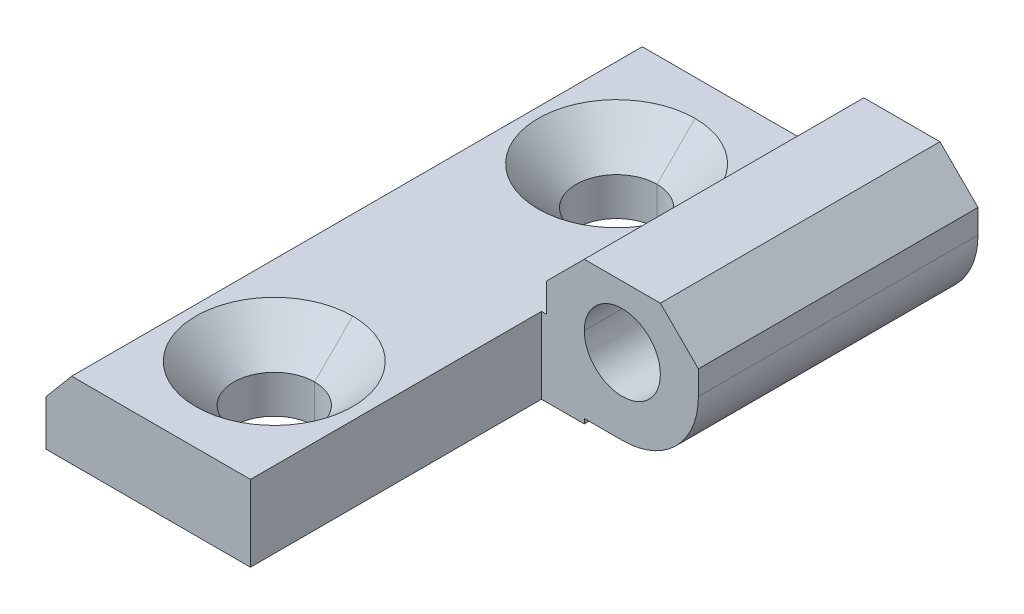
ISO-10303-21;
HEADER;
FILE_DESCRIPTION(('STEP AP214'),'2;1');
FILE_NAME('part.step','',(''),(''),'','','');
FILE_SCHEMA(('AUTOMOTIVE_DESIGN { 1 0 10303 214 1 1 1 1 }'));
ENDSEC;
DATA;
#1=APPLICATION_CONTEXT('core data for automotive mechanical design processes');
#2=APPLICATION_PROTOCOL_DEFINITION('international standard','automotive_design',2000,#1);
#3=PRODUCT_CONTEXT('',#1,'mechanical');
#4=PRODUCT('Part','Part','',(#3));
#5=PRODUCT_RELATED_PRODUCT_CATEGORY('part','',(#4));
#6=PRODUCT_DEFINITION_FORMATION('','',#4);
#7=PRODUCT_DEFINITION_CONTEXT('part definition',#1,'design');
#8=PRODUCT_DEFINITION('design','',#6,#7);
#9=PRODUCT_DEFINITION_SHAPE('','',#8);
#10=(LENGTH_UNIT() NAMED_UNIT(*) SI_UNIT(.MILLI.,.METRE.));
#11=(NAMED_UNIT(*) PLANE_ANGLE_UNIT() SI_UNIT($,.RADIAN.));
#12=(NAMED_UNIT(*) SI_UNIT($,.STERADIAN.) SOLID_ANGLE_UNIT());
#13=UNCERTAINTY_MEASURE_WITH_UNIT(LENGTH_MEASURE(1.E-05),#10,'distance_accuracy_value','');
#14=(GEOMETRIC_REPRESENTATION_CONTEXT(3) GLOBAL_UNCERTAINTY_ASSIGNED_CONTEXT((#13)) GLOBAL_UNIT_ASSIGNED_CONTEXT((#10,
#11,#12)) REPRESENTATION_CONTEXT('',''));
#15=CARTESIAN_POINT('',(0.,0.,0.));
#16=DIRECTION('',(0.,0.,1.));
#17=DIRECTION('',(1.,0.,0.));
#18=AXIS2_PLACEMENT_3D('',#15,#16,#17);
#19=CARTESIAN_POINT('',(0.,0.,60.));
#20=DIRECTION('',(0.,1.,0.));
#21=DIRECTION('',(0.,0.,1.));
#22=AXIS2_PLACEMENT_3D('',#19,#20,#21);
#23=PLANE('',#22);
#24=CARTESIAN_POINT('',(12.,0.,12.));
#25=DIRECTION('',(0.,-1.,0.));
#26=DIRECTION('',(0.,0.,-1.));
#27=AXIS2_PLACEMENT_3D('',#24,#25,#26);
#28=CIRCLE('',#27,4.25);
#29=CARTESIAN_POINT('',(12.,0.,16.25));
#30=VERTEX_POINT('',#29);
#31=CARTESIAN_POINT('',(12.,0.,7.75));
#32=VERTEX_POINT('',#31);
#33=EDGE_CURVE('E11',#30,#32,#28,.T.);
#34=ORIENTED_EDGE('',*,*,#33,.F.);
#35=CARTESIAN_POINT('',(12.,0.,12.));
#36=DIRECTION('',(0.,-1.,0.));
#37=DIRECTION('',(0.,0.,-1.));
#38=AXIS2_PLACEMENT_3D('',#35,#36,#37);
#39=CIRCLE('',#38,4.25);
#40=EDGE_CURVE('E26',#32,#30,#39,.T.);
#41=ORIENTED_EDGE('',*,*,#40,.F.);
#42=EDGE_LOOP('',(#34,#41));
#43=FACE_BOUND('',#42,.T.);
#44=CARTESIAN_POINT('',(12.,0.,48.));
#45=DIRECTION('',(0.,-1.,0.));
#46=DIRECTION('',(0.,0.,-1.));
#47=AXIS2_PLACEMENT_3D('',#44,#45,#46);
#48=CIRCLE('',#47,4.25);
#49=CARTESIAN_POINT('',(12.,0.,52.25));
#50=VERTEX_POINT('',#49);
#51=CARTESIAN_POINT('',(12.,0.,43.75));
#52=VERTEX_POINT('',#51);
#53=EDGE_CURVE('E578',#50,#52,#48,.T.);
#54=ORIENTED_EDGE('',*,*,#53,.F.);
#55=CARTESIAN_POINT('',(12.,0.,48.));
#56=DIRECTION('',(0.,-1.,0.));
#57=DIRECTION('',(0.,0.,-1.));
#58=AXIS2_PLACEMENT_3D('',#55,#56,#57);
#59=CIRCLE('',#58,4.25);
#60=EDGE_CURVE('E572',#52,#50,#59,.T.);
#61=ORIENTED_EDGE('',*,*,#60,.F.);
#62=EDGE_LOOP('',(#54,#61));
#63=FACE_BOUND('',#62,.T.);
#64=DIRECTION('',(0.,0.,-1.));
#65=VECTOR('',#64,1.);
#66=CARTESIAN_POINT('',(21.5,0.,60.));
#67=LINE('',#66,#65);
#68=CARTESIAN_POINT('',(21.5,0.,60.));
#69=VERTEX_POINT('',#68);
#70=CARTESIAN_POINT('',(21.5,0.,29.4));
#71=VERTEX_POINT('',#70);
#72=EDGE_CURVE('E566',#69,#71,#67,.T.);
#73=ORIENTED_EDGE('',*,*,#72,.F.);
#74=DIRECTION('',(1.,0.,0.));
#75=VECTOR('',#74,1.);
#76=CARTESIAN_POINT('',(0.,0.,60.));
#77=LINE('',#76,#75);
#78=CARTESIAN_POINT('',(0.,0.,60.));
#79=VERTEX_POINT('',#78);
#80=EDGE_CURVE('E560',#79,#69,#77,.T.);
#81=ORIENTED_EDGE('',*,*,#80,.F.);
#82=DIRECTION('',(0.,0.,-1.));
#83=VECTOR('',#82,1.);
#84=CARTESIAN_POINT('',(0.,0.,60.));
#85=LINE('',#84,#83);
#86=CARTESIAN_POINT('',(0.,0.,0.));
#87=VERTEX_POINT('',#86);
#88=EDGE_CURVE('E555',#79,#87,#85,.T.);
#89=ORIENTED_EDGE('',*,*,#88,.T.);
#90=DIRECTION('',(1.,0.,0.));
#91=VECTOR('',#90,1.);
#92=CARTESIAN_POINT('',(0.,0.,0.));
#93=LINE('',#92,#91);
#94=CARTESIAN_POINT('',(26.,0.,0.));
#95=VERTEX_POINT('',#94);
#96=EDGE_CURVE('E550',#87,#95,#93,.T.);
#97=ORIENTED_EDGE('',*,*,#96,.T.);
#98=DIRECTION('',(0.,0.,-1.));
#99=VECTOR('',#98,1.);
#100=CARTESIAN_POINT('',(26.,0.,60.));
#101=LINE('',#100,#99);
#102=CARTESIAN_POINT('',(26.,0.,29.4));
#103=VERTEX_POINT('',#102);
#104=EDGE_CURVE('E544',#103,#95,#101,.T.);
#105=ORIENTED_EDGE('',*,*,#104,.F.);
#106=DIRECTION('',(1.,0.,0.));
#107=VECTOR('',#106,1.);
#108=CARTESIAN_POINT('',(21.5,0.,29.4));
#109=LINE('',#108,#107);
#110=EDGE_CURVE('E538',#71,#103,#109,.T.);
#111=ORIENTED_EDGE('',*,*,#110,.F.);
#112=EDGE_LOOP('',(#73,#81,#89,#97,#105,#111));
#113=FACE_BOUND('',#112,.T.);
#114=ADVANCED_FACE('F17',(#43,#63,#113),#23,.F.);
#115=CARTESIAN_POINT('',(0.,0.,29.4));
#116=DIRECTION('',(0.,0.,1.));
#117=DIRECTION('',(1.,0.,0.));
#118=AXIS2_PLACEMENT_3D('',#115,#116,#117);
#119=PLANE('',#118);
#120=CARTESIAN_POINT('',(30.,8.5,29.4));
#121=DIRECTION('',(0.,0.,1.));
#122=DIRECTION('',(1.,0.,0.));
#123=AXIS2_PLACEMENT_3D('',#120,#121,#122);
#124=CIRCLE('',#123,4.);
#125=CARTESIAN_POINT('',(26.,8.5,29.4));
#126=VERTEX_POINT('',#125);
#127=CARTESIAN_POINT('',(34.,8.5,29.4));
#128=VERTEX_POINT('',#127);
#129=EDGE_CURVE('E224',#126,#128,#124,.T.);
#130=ORIENTED_EDGE('',*,*,#129,.F.);
#131=CARTESIAN_POINT('',(30.,8.5,29.4));
#132=DIRECTION('',(0.,0.,1.));
#133=DIRECTION('',(1.,0.,0.));
#134=AXIS2_PLACEMENT_3D('',#131,#132,#133);
#135=CIRCLE('',#134,4.);
#136=EDGE_CURVE('E529',#128,#126,#135,.T.);
#137=ORIENTED_EDGE('',*,*,#136,.F.);
#138=EDGE_LOOP('',(#130,#137));
#139=FACE_BOUND('',#138,.T.);
#140=DIRECTION('',(0.,1.,0.));
#141=VECTOR('',#140,1.);
#142=CARTESIAN_POINT('',(26.,0.,29.4));
#143=LINE('',#142,#141);
#144=CARTESIAN_POINT('',(26.,0.5,29.4));
#145=VERTEX_POINT('',#144);
#146=EDGE_CURVE('E524',#103,#145,#143,.T.);
#147=ORIENTED_EDGE('',*,*,#146,.T.);
#148=DIRECTION('',(1.,0.,0.));
#149=VECTOR('',#148,1.);
#150=CARTESIAN_POINT('',(26.,0.5,29.4));
#151=LINE('',#150,#149);
#152=CARTESIAN_POINT('',(30.,0.5,29.4));
#153=VERTEX_POINT('',#152);
#154=EDGE_CURVE('E519',#145,#153,#151,.T.);
#155=ORIENTED_EDGE('',*,*,#154,.T.);
#156=CARTESIAN_POINT('',(29.9999999999994,8.50000000000062,29.4));
#157=DIRECTION('',(0.,0.,1.));
#158=DIRECTION('',(1.,0.,0.));
#159=AXIS2_PLACEMENT_3D('',#156,#157,#158);
#160=CIRCLE('',#159,8.00000000000062);
#161=CARTESIAN_POINT('',(38.,8.5,29.4));
#162=VERTEX_POINT('',#161);
#163=EDGE_CURVE('E514',#153,#162,#160,.T.);
#164=ORIENTED_EDGE('',*,*,#163,.T.);
#165=DIRECTION('',(0.,1.,0.));
#166=VECTOR('',#165,1.);
#167=CARTESIAN_POINT('',(38.,0.,29.4));
#168=LINE('',#167,#166);
#169=CARTESIAN_POINT('',(38.,11.015640288664,29.4));
#170=VERTEX_POINT('',#169);
#171=EDGE_CURVE('E509',#162,#170,#168,.T.);
#172=ORIENTED_EDGE('',*,*,#171,.T.);
#173=DIRECTION('',(-0.708490549139333,0.705720299963269,0.));
#174=VECTOR('',#173,1.);
#175=CARTESIAN_POINT('',(38.,11.015640288664,29.4));
#176=LINE('',#175,#174);
#177=CARTESIAN_POINT('',(34.,15.,29.4));
#178=VERTEX_POINT('',#177);
#179=EDGE_CURVE('E504',#170,#178,#176,.T.);
#180=ORIENTED_EDGE('',*,*,#179,.T.);
#181=DIRECTION('',(-1.,0.,0.));
#182=VECTOR('',#181,1.);
#183=CARTESIAN_POINT('',(38.,15.,29.4));
#184=LINE('',#183,#182);
#185=CARTESIAN_POINT('',(26.,15.,29.4));
#186=VERTEX_POINT('',#185);
#187=EDGE_CURVE('E499',#178,#186,#184,.T.);
#188=ORIENTED_EDGE('',*,*,#187,.T.);
#189=DIRECTION('',(-0.707106781186548,-0.707106781186547,0.));
#190=VECTOR('',#189,1.);
#191=CARTESIAN_POINT('',(26.,15.,29.4));
#192=LINE('',#191,#190);
#193=CARTESIAN_POINT('',(22.015640288664,11.015640288664,29.4));
#194=VERTEX_POINT('',#193);
#195=EDGE_CURVE('E494',#186,#194,#192,.T.);
#196=ORIENTED_EDGE('',*,*,#195,.T.);
#197=DIRECTION('',(0.,-1.,0.));
#198=VECTOR('',#197,1.);
#199=CARTESIAN_POINT('',(22.015640288664,11.015640288664,29.4));
#200=LINE('',#199,#198);
#201=CARTESIAN_POINT('',(22.015640288664,8.,29.4));
#202=VERTEX_POINT('',#201);
#203=EDGE_CURVE('E489',#194,#202,#200,.T.);
#204=ORIENTED_EDGE('',*,*,#203,.T.);
#205=DIRECTION('',(-1.,0.,0.));
#206=VECTOR('',#205,1.);
#207=CARTESIAN_POINT('',(22.015640288664,8.,29.4));
#208=LINE('',#207,#206);
#209=CARTESIAN_POINT('',(21.5,8.,29.4));
#210=VERTEX_POINT('',#209);
#211=EDGE_CURVE('E484',#202,#210,#208,.T.);
#212=ORIENTED_EDGE('',*,*,#211,.T.);
#213=DIRECTION('',(0.,-1.,0.));
#214=VECTOR('',#213,1.);
#215=CARTESIAN_POINT('',(21.5,15.,29.4));
#216=LINE('',#215,#214);
#217=EDGE_CURVE('E478',#210,#71,#216,.T.);
#218=ORIENTED_EDGE('',*,*,#217,.T.);
#219=ORIENTED_EDGE('',*,*,#110,.T.);
#220=EDGE_LOOP('',(#147,#155,#164,#172,#180,#188,#196,#204,#212,#218,#219));
#221=FACE_BOUND('',#220,.T.);
#222=ADVANCED_FACE('F623',(#139,#221),#119,.T.);
#223=CARTESIAN_POINT('',(21.5,15.,60.));
#224=DIRECTION('',(1.,0.,0.));
#225=DIRECTION('',(0.,0.,-1.));
#226=AXIS2_PLACEMENT_3D('',#223,#224,#225);
#227=PLANE('',#226);
#228=DIRECTION('',(0.,0.,1.));
#229=VECTOR('',#228,1.);
#230=CARTESIAN_POINT('',(21.5,8.,60.));
#231=LINE('',#230,#229);
#232=CARTESIAN_POINT('',(21.5,8.,60.));
#233=VERTEX_POINT('',#232);
#234=EDGE_CURVE('E473',#210,#233,#231,.T.);
#235=ORIENTED_EDGE('',*,*,#234,.T.);
#236=DIRECTION('',(0.,1.,0.));
#237=VECTOR('',#236,1.);
#238=CARTESIAN_POINT('',(21.5,8.50000000000062,60.));
#239=LINE('',#238,#237);
#240=EDGE_CURVE('E467',#69,#233,#239,.T.);
#241=ORIENTED_EDGE('',*,*,#240,.F.);
#242=ORIENTED_EDGE('',*,*,#72,.T.);
#243=ORIENTED_EDGE('',*,*,#217,.F.);
#244=EDGE_LOOP('',(#235,#241,#242,#243));
#245=FACE_BOUND('',#244,.T.);
#246=ADVANCED_FACE('F621',(#245),#227,.T.);
#247=CARTESIAN_POINT('',(29.9999999999994,8.50000000000062,60.));
#248=DIRECTION('',(0.,0.,1.));
#249=DIRECTION('',(1.,0.,0.));
#250=AXIS2_PLACEMENT_3D('',#247,#248,#249);
#251=PLANE('',#250);
#252=ORIENTED_EDGE('',*,*,#80,.T.);
#253=ORIENTED_EDGE('',*,*,#240,.T.);
#254=DIRECTION('',(-1.,0.,0.));
#255=VECTOR('',#254,1.);
#256=CARTESIAN_POINT('',(22.015640288664,8.,60.));
#257=LINE('',#256,#255);
#258=CARTESIAN_POINT('',(2.6997079606835,8.,60.));
#259=VERTEX_POINT('',#258);
#260=EDGE_CURVE('E462',#233,#259,#257,.T.);
#261=ORIENTED_EDGE('',*,*,#260,.T.);
#262=DIRECTION('',(-0.642787609686545,-0.766044443118973,0.));
#263=VECTOR('',#262,1.);
#264=CARTESIAN_POINT('',(2.6997079606835,8.,60.));
#265=LINE('',#264,#263);
#266=CARTESIAN_POINT('',(0.,4.7826133389003,60.));
#267=VERTEX_POINT('',#266);
#268=EDGE_CURVE('E457',#259,#267,#265,.T.);
#269=ORIENTED_EDGE('',*,*,#268,.T.);
#270=DIRECTION('',(0.,-1.,0.));
#271=VECTOR('',#270,1.);
#272=CARTESIAN_POINT('',(0.,4.7826133389003,60.));
#273=LINE('',#272,#271);
#274=EDGE_CURVE('E451',#267,#79,#273,.T.);
#275=ORIENTED_EDGE('',*,*,#274,.T.);
#276=EDGE_LOOP('',(#252,#253,#261,#269,#275));
#277=FACE_BOUND('',#276,.T.);
#278=ADVANCED_FACE('F639',(#277),#251,.T.);
#279=CARTESIAN_POINT('',(0.,4.7826133389003,60.));
#280=DIRECTION('',(1.,0.,0.));
#281=DIRECTION('',(0.,0.,-1.));
#282=AXIS2_PLACEMENT_3D('',#279,#280,#281);
#283=PLANE('',#282);
#284=DIRECTION('',(0.,-1.,0.));
#285=VECTOR('',#284,1.);
#286=CARTESIAN_POINT('',(0.,4.7826133389003,0.));
#287=LINE('',#286,#285);
#288=CARTESIAN_POINT('',(0.,4.7826133389003,0.));
#289=VERTEX_POINT('',#288);
#290=EDGE_CURVE('E445',#289,#87,#287,.T.);
#291=ORIENTED_EDGE('',*,*,#290,.T.);
#292=ORIENTED_EDGE('',*,*,#88,.F.);
#293=ORIENTED_EDGE('',*,*,#274,.F.);
#294=DIRECTION('',(0.,0.,-1.));
#295=VECTOR('',#294,1.);
#296=CARTESIAN_POINT('',(0.,4.7826133389003,60.));
#297=LINE('',#296,#295);
#298=EDGE_CURVE('E440',#267,#289,#297,.T.);
#299=ORIENTED_EDGE('',*,*,#298,.T.);
#300=EDGE_LOOP('',(#291,#292,#293,#299));
#301=FACE_BOUND('',#300,.T.);
#302=ADVANCED_FACE('F848',(#301),#283,.F.);
#303=CARTESIAN_POINT('',(2.6997079606835,8.,60.));
#304=DIRECTION('',(0.766044443118973,-0.642787609686545,0.));
#305=DIRECTION('',(0.642787609686545,0.766044443118973,0.));
#306=AXIS2_PLACEMENT_3D('',#303,#304,#305);
#307=PLANE('',#306);
#308=DIRECTION('',(-0.642787609686545,-0.766044443118973,0.));
#309=VECTOR('',#308,1.);
#310=CARTESIAN_POINT('',(2.6997079606835,8.,0.));
#311=LINE('',#310,#309);
#312=CARTESIAN_POINT('',(2.6997079606835,8.,0.));
#313=VERTEX_POINT('',#312);
#314=EDGE_CURVE('E434',#313,#289,#311,.T.);
#315=ORIENTED_EDGE('',*,*,#314,.T.);
#316=ORIENTED_EDGE('',*,*,#298,.F.);
#317=ORIENTED_EDGE('',*,*,#268,.F.);
#318=DIRECTION('',(0.,0.,-1.));
#319=VECTOR('',#318,1.);
#320=CARTESIAN_POINT('',(2.6997079606835,8.,60.));
#321=LINE('',#320,#319);
#322=EDGE_CURVE('E429',#259,#313,#321,.T.);
#323=ORIENTED_EDGE('',*,*,#322,.T.);
#324=EDGE_LOOP('',(#315,#316,#317,#323));
#325=FACE_BOUND('',#324,.T.);
#326=ADVANCED_FACE('F609',(#325),#307,.F.);
#327=CARTESIAN_POINT('',(22.015640288664,8.,60.));
#328=DIRECTION('',(0.,-1.,0.));
#329=DIRECTION('',(0.,0.,-1.));
#330=AXIS2_PLACEMENT_3D('',#327,#328,#329);
#331=PLANE('',#330);
#332=CARTESIAN_POINT('',(12.,8.,12.));
#333=DIRECTION('',(0.,-1.,0.));
#334=DIRECTION('',(0.,0.,-1.));
#335=AXIS2_PLACEMENT_3D('',#332,#333,#334);
#336=CIRCLE('',#335,8.25);
#337=CARTESIAN_POINT('',(12.,8.,3.75));
#338=VERTEX_POINT('',#337);
#339=CARTESIAN_POINT('',(12.,8.,20.25));
#340=VERTEX_POINT('',#339);
#341=EDGE_CURVE('E424',#338,#340,#336,.T.);
#342=ORIENTED_EDGE('',*,*,#341,.T.);
#343=CARTESIAN_POINT('',(12.,8.,12.));
#344=DIRECTION('',(0.,-1.,0.));
#345=DIRECTION('',(0.,0.,-1.));
#346=AXIS2_PLACEMENT_3D('',#343,#344,#345);
#347=CIRCLE('',#346,8.25);
#348=EDGE_CURVE('E420',#340,#338,#347,.T.);
#349=ORIENTED_EDGE('',*,*,#348,.T.);
#350=EDGE_LOOP('',(#342,#349));
#351=FACE_BOUND('',#350,.T.);
#352=CARTESIAN_POINT('',(12.,8.,48.));
#353=DIRECTION('',(0.,-1.,0.));
#354=DIRECTION('',(0.,0.,-1.));
#355=AXIS2_PLACEMENT_3D('',#352,#353,#354);
#356=CIRCLE('',#355,8.25);
#357=CARTESIAN_POINT('',(12.,8.,39.75));
#358=VERTEX_POINT('',#357);
#359=CARTESIAN_POINT('',(12.,8.,56.25));
#360=VERTEX_POINT('',#359);
#361=EDGE_CURVE('E415',#358,#360,#356,.T.);
#362=ORIENTED_EDGE('',*,*,#361,.T.);
#363=CARTESIAN_POINT('',(12.,8.,48.));
#364=DIRECTION('',(0.,-1.,0.));
#365=DIRECTION('',(0.,0.,-1.));
#366=AXIS2_PLACEMENT_3D('',#363,#364,#365);
#367=CIRCLE('',#366,8.25);
#368=EDGE_CURVE('E410',#360,#358,#367,.T.);
#369=ORIENTED_EDGE('',*,*,#368,.T.);
#370=EDGE_LOOP('',(#362,#369));
#371=FACE_BOUND('',#370,.T.);
#372=ORIENTED_EDGE('',*,*,#234,.F.);
#373=ORIENTED_EDGE('',*,*,#211,.F.);
#374=DIRECTION('',(0.,0.,-1.));
#375=VECTOR('',#374,1.);
#376=CARTESIAN_POINT('',(22.015640288664,8.,60.));
#377=LINE('',#376,#375);
#378=CARTESIAN_POINT('',(22.015640288664,8.,0.));
#379=VERTEX_POINT('',#378);
#380=EDGE_CURVE('E405',#202,#379,#377,.T.);
#381=ORIENTED_EDGE('',*,*,#380,.T.);
#382=DIRECTION('',(-1.,0.,0.));
#383=VECTOR('',#382,1.);
#384=CARTESIAN_POINT('',(22.015640288664,8.,0.));
#385=LINE('',#384,#383);
#386=EDGE_CURVE('E399',#379,#313,#385,.T.);
#387=ORIENTED_EDGE('',*,*,#386,.T.);
#388=ORIENTED_EDGE('',*,*,#322,.F.);
#389=ORIENTED_EDGE('',*,*,#260,.F.);
#390=EDGE_LOOP('',(#372,#373,#381,#387,#388,#389));
#391=FACE_BOUND('',#390,.T.);
#392=ADVANCED_FACE('F605',(#351,#371,#391),#331,.F.);
#393=CARTESIAN_POINT('',(29.9999999999994,8.50000000000062,0.));
#394=DIRECTION('',(0.,0.,1.));
#395=DIRECTION('',(1.,0.,0.));
#396=AXIS2_PLACEMENT_3D('',#393,#394,#395);
#397=PLANE('',#396);
#398=ORIENTED_EDGE('',*,*,#314,.F.);
#399=ORIENTED_EDGE('',*,*,#386,.F.);
#400=DIRECTION('',(0.,-1.,0.));
#401=VECTOR('',#400,1.);
#402=CARTESIAN_POINT('',(22.015640288664,11.015640288664,0.));
#403=LINE('',#402,#401);
#404=CARTESIAN_POINT('',(22.015640288664,11.015640288664,0.));
#405=VERTEX_POINT('',#404);
#406=EDGE_CURVE('E393',#405,#379,#403,.T.);
#407=ORIENTED_EDGE('',*,*,#406,.F.);
#408=DIRECTION('',(-0.707106781186548,-0.707106781186547,0.));
#409=VECTOR('',#408,1.);
#410=CARTESIAN_POINT('',(26.,15.,0.));
#411=LINE('',#410,#409);
#412=CARTESIAN_POINT('',(26.,15.,0.));
#413=VERTEX_POINT('',#412);
#414=EDGE_CURVE('E387',#413,#405,#411,.T.);
#415=ORIENTED_EDGE('',*,*,#414,.F.);
#416=DIRECTION('',(-1.,0.,0.));
#417=VECTOR('',#416,1.);
#418=CARTESIAN_POINT('',(34.,15.,0.));
#419=LINE('',#418,#417);
#420=CARTESIAN_POINT('',(34.,15.,0.));
#421=VERTEX_POINT('',#420);
#422=EDGE_CURVE('E381',#421,#413,#419,.T.);
#423=ORIENTED_EDGE('',*,*,#422,.F.);
#424=DIRECTION('',(-0.708490549139333,0.705720299963269,0.));
#425=VECTOR('',#424,1.);
#426=CARTESIAN_POINT('',(38.,11.015640288664,0.));
#427=LINE('',#426,#425);
#428=CARTESIAN_POINT('',(38.,11.015640288664,0.));
#429=VERTEX_POINT('',#428);
#430=EDGE_CURVE('E375',#429,#421,#427,.T.);
#431=ORIENTED_EDGE('',*,*,#430,.F.);
#432=DIRECTION('',(0.,1.,0.));
#433=VECTOR('',#432,1.);
#434=CARTESIAN_POINT('',(38.,8.5,0.));
#435=LINE('',#434,#433);
#436=CARTESIAN_POINT('',(38.,8.5,0.));
#437=VERTEX_POINT('',#436);
#438=EDGE_CURVE('E369',#437,#429,#435,.T.);
#439=ORIENTED_EDGE('',*,*,#438,.F.);
#440=CARTESIAN_POINT('',(29.9999999999994,8.50000000000062,0.));
#441=DIRECTION('',(0.,0.,1.));
#442=DIRECTION('',(1.,0.,0.));
#443=AXIS2_PLACEMENT_3D('',#440,#441,#442);
#444=CIRCLE('',#443,8.00000000000062);
#445=CARTESIAN_POINT('',(30.,0.5,0.));
#446=VERTEX_POINT('',#445);
#447=EDGE_CURVE('E363',#446,#437,#444,.T.);
#448=ORIENTED_EDGE('',*,*,#447,.F.);
#449=DIRECTION('',(1.,0.,0.));
#450=VECTOR('',#449,1.);
#451=CARTESIAN_POINT('',(26.,0.5,0.));
#452=LINE('',#451,#450);
#453=CARTESIAN_POINT('',(26.,0.5,0.));
#454=VERTEX_POINT('',#453);
#455=EDGE_CURVE('E357',#454,#446,#452,.T.);
#456=ORIENTED_EDGE('',*,*,#455,.F.);
#457=DIRECTION('',(0.,1.,0.));
#458=VECTOR('',#457,1.);
#459=CARTESIAN_POINT('',(26.,0.,0.));
#460=LINE('',#459,#458);
#461=EDGE_CURVE('E351',#95,#454,#460,.T.);
#462=ORIENTED_EDGE('',*,*,#461,.F.);
#463=ORIENTED_EDGE('',*,*,#96,.F.);
#464=ORIENTED_EDGE('',*,*,#290,.F.);
#465=EDGE_LOOP('',(#398,#399,#407,#415,#423,#431,#439,#448,#456,#462,#463,#464));
#466=FACE_BOUND('',#465,.T.);
#467=ADVANCED_FACE('F608',(#466),#397,.F.);
#468=CARTESIAN_POINT('',(26.,0.,60.));
#469=DIRECTION('',(-1.,0.,0.));
#470=DIRECTION('',(0.,0.,1.));
#471=AXIS2_PLACEMENT_3D('',#468,#469,#470);
#472=PLANE('',#471);
#473=ORIENTED_EDGE('',*,*,#146,.F.);
#474=ORIENTED_EDGE('',*,*,#104,.T.);
#475=ORIENTED_EDGE('',*,*,#461,.T.);
#476=DIRECTION('',(0.,0.,-1.));
#477=VECTOR('',#476,1.);
#478=CARTESIAN_POINT('',(26.,0.5,60.));
#479=LINE('',#478,#477);
#480=EDGE_CURVE('E345',#145,#454,#479,.T.);
#481=ORIENTED_EDGE('',*,*,#480,.F.);
#482=EDGE_LOOP('',(#473,#474,#475,#481));
#483=FACE_BOUND('',#482,.T.);
#484=ADVANCED_FACE('F646',(#483),#472,.F.);
#485=CARTESIAN_POINT('',(26.,0.5,60.));
#486=DIRECTION('',(0.,1.,0.));
#487=DIRECTION('',(0.,0.,1.));
#488=AXIS2_PLACEMENT_3D('',#485,#486,#487);
#489=PLANE('',#488);
#490=ORIENTED_EDGE('',*,*,#154,.F.);
#491=ORIENTED_EDGE('',*,*,#480,.T.);
#492=ORIENTED_EDGE('',*,*,#455,.T.);
#493=DIRECTION('',(0.,0.,-1.));
#494=VECTOR('',#493,1.);
#495=CARTESIAN_POINT('',(30.,0.5,60.));
#496=LINE('',#495,#494);
#497=EDGE_CURVE('E339',#153,#446,#496,.T.);
#498=ORIENTED_EDGE('',*,*,#497,.F.);
#499=EDGE_LOOP('',(#490,#491,#492,#498));
#500=FACE_BOUND('',#499,.T.);
#501=ADVANCED_FACE('F652',(#500),#489,.F.);
#502=CARTESIAN_POINT('',(29.9999999999994,8.50000000000062,60.));
#503=DIRECTION('',(0.,0.,-1.));
#504=DIRECTION('',(-0.707106781186574,0.707106781186521,0.));
#505=AXIS2_PLACEMENT_3D('',#502,#503,#504);
#506=CYLINDRICAL_SURFACE('',#505,8.00000000000062);
#507=ORIENTED_EDGE('',*,*,#163,.F.);
#508=ORIENTED_EDGE('',*,*,#497,.T.);
#509=ORIENTED_EDGE('',*,*,#447,.T.);
#510=DIRECTION('',(0.,0.,-1.));
#511=VECTOR('',#510,1.);
#512=CARTESIAN_POINT('',(38.,8.5,60.));
#513=LINE('',#512,#511);
#514=EDGE_CURVE('E333',#162,#437,#513,.T.);
#515=ORIENTED_EDGE('',*,*,#514,.F.);
#516=EDGE_LOOP('',(#507,#508,#509,#515));
#517=FACE_BOUND('',#516,.T.);
#518=ADVANCED_FACE('F654',(#517),#506,.T.);
#519=CARTESIAN_POINT('',(38.,8.5,60.));
#520=DIRECTION('',(-1.,0.,0.));
#521=DIRECTION('',(0.,0.,1.));
#522=AXIS2_PLACEMENT_3D('',#519,#520,#521);
#523=PLANE('',#522);
#524=ORIENTED_EDGE('',*,*,#171,.F.);
#525=ORIENTED_EDGE('',*,*,#514,.T.);
#526=ORIENTED_EDGE('',*,*,#438,.T.);
#527=DIRECTION('',(0.,0.,-1.));
#528=VECTOR('',#527,1.);
#529=CARTESIAN_POINT('',(38.,11.015640288664,60.));
#530=LINE('',#529,#528);
#531=EDGE_CURVE('E327',#170,#429,#530,.T.);
#532=ORIENTED_EDGE('',*,*,#531,.F.);
#533=EDGE_LOOP('',(#524,#525,#526,#532));
#534=FACE_BOUND('',#533,.T.);
#535=ADVANCED_FACE('F658',(#534),#523,.F.);
#536=CARTESIAN_POINT('',(38.,11.015640288664,60.));
#537=DIRECTION('',(-0.705720299963269,-0.708490549139333,0.));
#538=DIRECTION('',(0.708490549139333,-0.705720299963269,0.));
#539=AXIS2_PLACEMENT_3D('',#536,#537,#538);
#540=PLANE('',#539);
#541=ORIENTED_EDGE('',*,*,#179,.F.);
#542=ORIENTED_EDGE('',*,*,#531,.T.);
#543=ORIENTED_EDGE('',*,*,#430,.T.);
#544=DIRECTION('',(0.,0.,-1.));
#545=VECTOR('',#544,1.);
#546=CARTESIAN_POINT('',(34.,15.,60.));
#547=LINE('',#546,#545);
#548=EDGE_CURVE('E321',#178,#421,#547,.T.);
#549=ORIENTED_EDGE('',*,*,#548,.F.);
#550=EDGE_LOOP('',(#541,#542,#543,#549));
#551=FACE_BOUND('',#550,.T.);
#552=ADVANCED_FACE('F664',(#551),#540,.F.);
#553=CARTESIAN_POINT('',(34.,15.,60.));
#554=DIRECTION('',(0.,-1.,0.));
#555=DIRECTION('',(0.,0.,-1.));
#556=AXIS2_PLACEMENT_3D('',#553,#554,#555);
#557=PLANE('',#556);
#558=ORIENTED_EDGE('',*,*,#187,.F.);
#559=ORIENTED_EDGE('',*,*,#548,.T.);
#560=ORIENTED_EDGE('',*,*,#422,.T.);
#561=DIRECTION('',(0.,0.,-1.));
#562=VECTOR('',#561,1.);
#563=CARTESIAN_POINT('',(26.,15.,60.));
#564=LINE('',#563,#562);
#565=EDGE_CURVE('E315',#186,#413,#564,.T.);
#566=ORIENTED_EDGE('',*,*,#565,.F.);
#567=EDGE_LOOP('',(#558,#559,#560,#566));
#568=FACE_BOUND('',#567,.T.);
#569=ADVANCED_FACE('F666',(#568),#557,.F.);
#570=CARTESIAN_POINT('',(26.,15.,60.));
#571=DIRECTION('',(0.707106781186547,-0.707106781186548,0.));
#572=DIRECTION('',(0.707106781186548,0.707106781186547,0.));
#573=AXIS2_PLACEMENT_3D('',#570,#571,#572);
#574=PLANE('',#573);
#575=ORIENTED_EDGE('',*,*,#195,.F.);
#576=ORIENTED_EDGE('',*,*,#565,.T.);
#577=ORIENTED_EDGE('',*,*,#414,.T.);
#578=DIRECTION('',(0.,0.,-1.));
#579=VECTOR('',#578,1.);
#580=CARTESIAN_POINT('',(22.015640288664,11.015640288664,60.));
#581=LINE('',#580,#579);
#582=EDGE_CURVE('E309',#194,#405,#581,.T.);
#583=ORIENTED_EDGE('',*,*,#582,.F.);
#584=EDGE_LOOP('',(#575,#576,#577,#583));
#585=FACE_BOUND('',#584,.T.);
#586=ADVANCED_FACE('F668',(#585),#574,.F.);
#587=CARTESIAN_POINT('',(22.015640288664,11.015640288664,60.));
#588=DIRECTION('',(1.,0.,0.));
#589=DIRECTION('',(0.,0.,-1.));
#590=AXIS2_PLACEMENT_3D('',#587,#588,#589);
#591=PLANE('',#590);
#592=ORIENTED_EDGE('',*,*,#203,.F.);
#593=ORIENTED_EDGE('',*,*,#582,.T.);
#594=ORIENTED_EDGE('',*,*,#406,.T.);
#595=ORIENTED_EDGE('',*,*,#380,.F.);
#596=EDGE_LOOP('',(#592,#593,#594,#595));
#597=FACE_BOUND('',#596,.T.);
#598=ADVANCED_FACE('F628',(#597),#591,.F.);
#599=CARTESIAN_POINT('',(12.,8.,48.));
#600=DIRECTION('',(0.,1.,0.));
#601=DIRECTION('',(1.,0.,0.));
#602=AXIS2_PLACEMENT_3D('',#599,#600,#601);
#603=CONICAL_SURFACE('',#602,8.25,0.785398163397448);
#604=DIRECTION('',(0.,0.707106781186547,-0.707106781186548));
#605=VECTOR('',#604,1.);
#606=CARTESIAN_POINT('',(12.,4.,43.75));
#607=LINE('',#606,#605);
#608=CARTESIAN_POINT('',(12.,4.,43.75));
#609=VERTEX_POINT('',#608);
#610=EDGE_CURVE('E303',#609,#358,#607,.T.);
#611=ORIENTED_EDGE('',*,*,#610,.T.);
#612=ORIENTED_EDGE('',*,*,#368,.F.);
#613=DIRECTION('',(0.,0.707106781186547,0.707106781186548));
#614=VECTOR('',#613,1.);
#615=CARTESIAN_POINT('',(12.,4.,52.25));
#616=LINE('',#615,#614);
#617=CARTESIAN_POINT('',(12.,4.,52.25));
#618=VERTEX_POINT('',#617);
#619=EDGE_CURVE('E297',#618,#360,#616,.T.);
#620=ORIENTED_EDGE('',*,*,#619,.F.);
#621=CARTESIAN_POINT('',(12.,4.,48.));
#622=DIRECTION('',(0.,-1.,0.));
#623=DIRECTION('',(0.,0.,-1.));
#624=AXIS2_PLACEMENT_3D('',#621,#622,#623);
#625=CIRCLE('',#624,4.25);
#626=EDGE_CURVE('E292',#618,#609,#625,.T.);
#627=ORIENTED_EDGE('',*,*,#626,.T.);
#628=EDGE_LOOP('',(#611,#612,#620,#627));
#629=FACE_BOUND('',#628,.T.);
#630=ADVANCED_FACE('F676',(#629),#603,.F.);
#631=CARTESIAN_POINT('',(12.,0.,48.));
#632=DIRECTION('',(0.,-1.,0.));
#633=DIRECTION('',(1.,0.,0.));
#634=AXIS2_PLACEMENT_3D('',#631,#632,#633);
#635=CYLINDRICAL_SURFACE('',#634,4.25);
#636=DIRECTION('',(0.,-1.,0.));
#637=VECTOR('',#636,1.);
#638=CARTESIAN_POINT('',(12.,4.,52.25));
#639=LINE('',#638,#637);
#640=EDGE_CURVE('E286',#618,#50,#639,.T.);
#641=ORIENTED_EDGE('',*,*,#640,.T.);
#642=ORIENTED_EDGE('',*,*,#53,.T.);
#643=DIRECTION('',(0.,-1.,0.));
#644=VECTOR('',#643,1.);
#645=CARTESIAN_POINT('',(12.,4.,43.75));
#646=LINE('',#645,#644);
#647=EDGE_CURVE('E280',#609,#52,#646,.T.);
#648=ORIENTED_EDGE('',*,*,#647,.F.);
#649=ORIENTED_EDGE('',*,*,#626,.F.);
#650=EDGE_LOOP('',(#641,#642,#648,#649));
#651=FACE_BOUND('',#650,.T.);
#652=ADVANCED_FACE('F689',(#651),#635,.F.);
#653=CARTESIAN_POINT('',(12.,0.,48.));
#654=DIRECTION('',(0.,-1.,0.));
#655=DIRECTION('',(-1.,0.,0.));
#656=AXIS2_PLACEMENT_3D('',#653,#654,#655);
#657=CYLINDRICAL_SURFACE('',#656,4.25);
#658=ORIENTED_EDGE('',*,*,#640,.F.);
#659=CARTESIAN_POINT('',(12.,4.,48.));
#660=DIRECTION('',(0.,-1.,0.));
#661=DIRECTION('',(0.,0.,-1.));
#662=AXIS2_PLACEMENT_3D('',#659,#660,#661);
#663=CIRCLE('',#662,4.25);
#664=EDGE_CURVE('E274',#609,#618,#663,.T.);
#665=ORIENTED_EDGE('',*,*,#664,.F.);
#666=ORIENTED_EDGE('',*,*,#647,.T.);
#667=ORIENTED_EDGE('',*,*,#60,.T.);
#668=EDGE_LOOP('',(#658,#665,#666,#667));
#669=FACE_BOUND('',#668,.T.);
#670=ADVANCED_FACE('F692',(#669),#657,.F.);
#671=CARTESIAN_POINT('',(12.,8.,48.));
#672=DIRECTION('',(0.,1.,0.));
#673=DIRECTION('',(-1.,0.,0.));
#674=AXIS2_PLACEMENT_3D('',#671,#672,#673);
#675=CONICAL_SURFACE('',#674,8.25,0.785398163397448);
#676=ORIENTED_EDGE('',*,*,#610,.F.);
#677=ORIENTED_EDGE('',*,*,#664,.T.);
#678=ORIENTED_EDGE('',*,*,#619,.T.);
#679=ORIENTED_EDGE('',*,*,#361,.F.);
#680=EDGE_LOOP('',(#676,#677,#678,#679));
#681=FACE_BOUND('',#680,.T.);
#682=ADVANCED_FACE('F695',(#681),#675,.F.);
#683=CARTESIAN_POINT('',(12.,8.,12.));
#684=DIRECTION('',(0.,1.,0.));
#685=DIRECTION('',(1.,0.,0.));
#686=AXIS2_PLACEMENT_3D('',#683,#684,#685);
#687=CONICAL_SURFACE('',#686,8.25,0.785398163397448);
#688=DIRECTION('',(0.,0.707106781186548,-0.707106781186547));
#689=VECTOR('',#688,1.);
#690=CARTESIAN_POINT('',(12.,4.,7.75));
#691=LINE('',#690,#689);
#692=CARTESIAN_POINT('',(12.,4.,7.75));
#693=VERTEX_POINT('',#692);
#694=EDGE_CURVE('E268',#693,#338,#691,.T.);
#695=ORIENTED_EDGE('',*,*,#694,.T.);
#696=ORIENTED_EDGE('',*,*,#348,.F.);
#697=DIRECTION('',(0.,0.707106781186547,0.707106781186548));
#698=VECTOR('',#697,1.);
#699=CARTESIAN_POINT('',(12.,4.,16.25));
#700=LINE('',#699,#698);
#701=CARTESIAN_POINT('',(12.,4.,16.25));
#702=VERTEX_POINT('',#701);
#703=EDGE_CURVE('E262',#702,#340,#700,.T.);
#704=ORIENTED_EDGE('',*,*,#703,.F.);
#705=CARTESIAN_POINT('',(12.,4.,12.));
#706=DIRECTION('',(0.,-1.,0.));
#707=DIRECTION('',(0.,0.,-1.));
#708=AXIS2_PLACEMENT_3D('',#705,#706,#707);
#709=CIRCLE('',#708,4.25);
#710=EDGE_CURVE('E257',#702,#693,#709,.T.);
#711=ORIENTED_EDGE('',*,*,#710,.T.);
#712=EDGE_LOOP('',(#695,#696,#704,#711));
#713=FACE_BOUND('',#712,.T.);
#714=ADVANCED_FACE('F599',(#713),#687,.F.);
#715=CARTESIAN_POINT('',(12.,0.,12.));
#716=DIRECTION('',(0.,-1.,0.));
#717=DIRECTION('',(1.,0.,0.));
#718=AXIS2_PLACEMENT_3D('',#715,#716,#717);
#719=CYLINDRICAL_SURFACE('',#718,4.25);
#720=DIRECTION('',(0.,-1.,0.));
#721=VECTOR('',#720,1.);
#722=CARTESIAN_POINT('',(12.,4.,16.25));
#723=LINE('',#722,#721);
#724=EDGE_CURVE('E252',#702,#30,#723,.T.);
#725=ORIENTED_EDGE('',*,*,#724,.T.);
#726=ORIENTED_EDGE('',*,*,#33,.T.);
#727=DIRECTION('',(0.,-1.,0.));
#728=VECTOR('',#727,1.);
#729=CARTESIAN_POINT('',(12.,4.,7.75));
#730=LINE('',#729,#728);
#731=EDGE_CURVE('E247',#693,#32,#730,.T.);
#732=ORIENTED_EDGE('',*,*,#731,.F.);
#733=ORIENTED_EDGE('',*,*,#710,.F.);
#734=EDGE_LOOP('',(#725,#726,#732,#733));
#735=FACE_BOUND('',#734,.T.);
#736=ADVANCED_FACE('F597',(#735),#719,.F.);
#737=CARTESIAN_POINT('',(12.,0.,12.));
#738=DIRECTION('',(0.,-1.,0.));
#739=DIRECTION('',(-1.,0.,0.));
#740=AXIS2_PLACEMENT_3D('',#737,#738,#739);
#741=CYLINDRICAL_SURFACE('',#740,4.25);
#742=ORIENTED_EDGE('',*,*,#724,.F.);
#743=CARTESIAN_POINT('',(12.,4.,12.));
#744=DIRECTION('',(0.,-1.,0.));
#745=DIRECTION('',(0.,0.,-1.));
#746=AXIS2_PLACEMENT_3D('',#743,#744,#745);
#747=CIRCLE('',#746,4.25);
#748=EDGE_CURVE('E241',#693,#702,#747,.T.);
#749=ORIENTED_EDGE('',*,*,#748,.F.);
#750=ORIENTED_EDGE('',*,*,#731,.T.);
#751=ORIENTED_EDGE('',*,*,#40,.T.);
#752=EDGE_LOOP('',(#742,#749,#750,#751));
#753=FACE_BOUND('',#752,.T.);
#754=ADVANCED_FACE('F591',(#753),#741,.F.);
#755=CARTESIAN_POINT('',(12.,8.,12.));
#756=DIRECTION('',(0.,1.,0.));
#757=DIRECTION('',(-1.,0.,0.));
#758=AXIS2_PLACEMENT_3D('',#755,#756,#757);
#759=CONICAL_SURFACE('',#758,8.25,0.785398163397448);
#760=ORIENTED_EDGE('',*,*,#694,.F.);
#761=ORIENTED_EDGE('',*,*,#748,.T.);
#762=ORIENTED_EDGE('',*,*,#703,.T.);
#763=ORIENTED_EDGE('',*,*,#341,.F.);
#764=EDGE_LOOP('',(#760,#761,#762,#763));
#765=FACE_BOUND('',#764,.T.);
#766=ADVANCED_FACE('F603',(#765),#759,.F.);
#767=CARTESIAN_POINT('',(30.,8.5,15.36));
#768=DIRECTION('',(0.,0.,1.));
#769=DIRECTION('',(0.,-1.,0.));
#770=AXIS2_PLACEMENT_3D('',#767,#768,#769);
#771=CYLINDRICAL_SURFACE('',#770,4.);
#772=DIRECTION('',(0.,0.,1.));
#773=VECTOR('',#772,1.);
#774=CARTESIAN_POINT('',(26.,8.5,15.36));
#775=LINE('',#774,#773);
#776=CARTESIAN_POINT('',(26.,8.5,15.36));
#777=VERTEX_POINT('',#776);
#778=EDGE_CURVE('E215',#777,#126,#775,.T.);
#779=ORIENTED_EDGE('',*,*,#778,.F.);
#780=CARTESIAN_POINT('',(30.,8.5,15.36));
#781=DIRECTION('',(0.,0.,1.));
#782=DIRECTION('',(1.,0.,0.));
#783=AXIS2_PLACEMENT_3D('',#780,#781,#782);
#784=CIRCLE('',#783,4.);
#785=CARTESIAN_POINT('',(34.,8.5,15.36));
#786=VERTEX_POINT('',#785);
#787=EDGE_CURVE('E208',#786,#777,#784,.T.);
#788=ORIENTED_EDGE('',*,*,#787,.F.);
#789=DIRECTION('',(0.,0.,1.));
#790=VECTOR('',#789,1.);
#791=CARTESIAN_POINT('',(34.,8.5,15.36));
#792=LINE('',#791,#790);
#793=EDGE_CURVE('E212',#786,#128,#792,.T.);
#794=ORIENTED_EDGE('',*,*,#793,.T.);
#795=ORIENTED_EDGE('',*,*,#136,.T.);
#796=EDGE_LOOP('',(#779,#788,#794,#795));
#797=FACE_BOUND('',#796,.T.);
#798=ADVANCED_FACE('F210',(#797),#771,.F.);
#799=CARTESIAN_POINT('',(30.,8.5,15.36));
#800=DIRECTION('',(0.,0.,1.));
#801=DIRECTION('',(0.,1.,0.));
#802=AXIS2_PLACEMENT_3D('',#799,#800,#801);
#803=CYLINDRICAL_SURFACE('',#802,4.);
#804=ORIENTED_EDGE('',*,*,#778,.T.);
#805=ORIENTED_EDGE('',*,*,#129,.T.);
#806=ORIENTED_EDGE('',*,*,#793,.F.);
#807=CARTESIAN_POINT('',(30.,8.5,15.36));
#808=DIRECTION('',(0.,0.,1.));
#809=DIRECTION('',(1.,0.,0.));
#810=AXIS2_PLACEMENT_3D('',#807,#808,#809);
#811=CIRCLE('',#810,4.);
#812=EDGE_CURVE('E223',#777,#786,#811,.T.);
#813=ORIENTED_EDGE('',*,*,#812,.F.);
#814=EDGE_LOOP('',(#804,#805,#806,#813));
#815=FACE_BOUND('',#814,.T.);
#816=ADVANCED_FACE('F222',(#815),#803,.F.);
#817=CARTESIAN_POINT('',(30.,8.5,15.36));
#818=DIRECTION('',(0.,0.,1.));
#819=DIRECTION('',(1.,0.,0.));
#820=AXIS2_PLACEMENT_3D('',#817,#818,#819);
#821=PLANE('',#820);
#822=ORIENTED_EDGE('',*,*,#787,.T.);
#823=ORIENTED_EDGE('',*,*,#812,.T.);
#824=EDGE_LOOP('',(#822,#823));
#825=FACE_BOUND('',#824,.T.);
#826=ADVANCED_FACE('F227',(#825),#821,.T.);
#827=CLOSED_SHELL('',(#114,#222,#246,#278,#302,#326,#392,#467,#484,#501,#518,#535,#552,#569,
#586,#598,#630,#652,#670,#682,#714,#736,#754,#766,#798,#816,#826));
#828=MANIFOLD_SOLID_BREP('B1',#827);
#829=ADVANCED_BREP_SHAPE_REPRESENTATION('',(#18,#828),#14);
#830=SHAPE_DEFINITION_REPRESENTATION(#9,#829);
ENDSEC;
END-ISO-10303-21;
